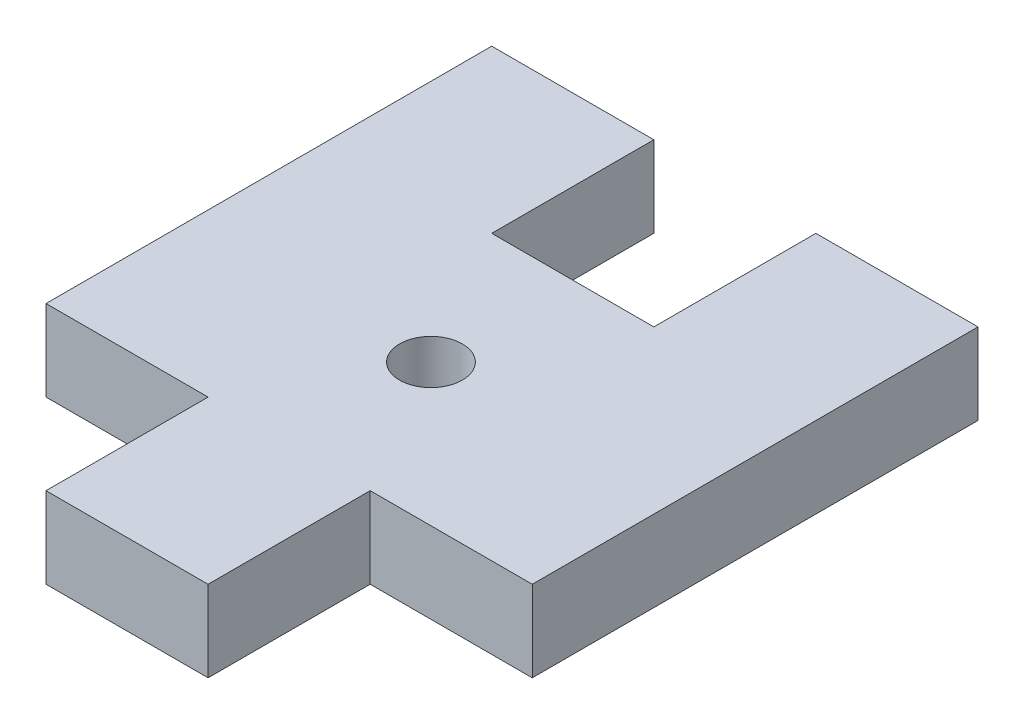
ISO-10303-21;
HEADER;
FILE_DESCRIPTION(('STEP AP214'),'2;1');
FILE_NAME('part.step','',(''),(''),'','','');
FILE_SCHEMA(('AUTOMOTIVE_DESIGN { 1 0 10303 214 1 1 1 1 }'));
ENDSEC;
DATA;
#1=APPLICATION_CONTEXT('core data for automotive mechanical design processes');
#2=APPLICATION_PROTOCOL_DEFINITION('international standard','automotive_design',2000,#1);
#3=PRODUCT_CONTEXT('',#1,'mechanical');
#4=PRODUCT('Part','Part','',(#3));
#5=PRODUCT_RELATED_PRODUCT_CATEGORY('part','',(#4));
#6=PRODUCT_DEFINITION_FORMATION('','',#4);
#7=PRODUCT_DEFINITION_CONTEXT('part definition',#1,'design');
#8=PRODUCT_DEFINITION('design','',#6,#7);
#9=PRODUCT_DEFINITION_SHAPE('','',#8);
#10=(LENGTH_UNIT() NAMED_UNIT(*) SI_UNIT(.MILLI.,.METRE.));
#11=(NAMED_UNIT(*) PLANE_ANGLE_UNIT() SI_UNIT($,.RADIAN.));
#12=(NAMED_UNIT(*) SI_UNIT($,.STERADIAN.) SOLID_ANGLE_UNIT());
#13=UNCERTAINTY_MEASURE_WITH_UNIT(LENGTH_MEASURE(1.E-05),#10,'distance_accuracy_value','');
#14=(GEOMETRIC_REPRESENTATION_CONTEXT(3) GLOBAL_UNCERTAINTY_ASSIGNED_CONTEXT((#13)) GLOBAL_UNIT_ASSIGNED_CONTEXT((#10,
#11,#12)) REPRESENTATION_CONTEXT('',''));
#15=CARTESIAN_POINT('',(0.,0.,0.));
#16=DIRECTION('',(0.,0.,1.));
#17=DIRECTION('',(1.,0.,0.));
#18=AXIS2_PLACEMENT_3D('',#15,#16,#17);
#19=CARTESIAN_POINT('',(4.,0.,-7.));
#20=DIRECTION('',(0.,0.,-1.));
#21=DIRECTION('',(-1.,0.,0.));
#22=AXIS2_PLACEMENT_3D('',#19,#20,#21);
#23=PLANE('',#22);
#24=DIRECTION('',(-1.,0.,0.));
#25=VECTOR('',#24,1.);
#26=CARTESIAN_POINT('',(4.,4.,-7.));
#27=LINE('',#26,#25);
#28=CARTESIAN_POINT('',(4.,4.,-7.));
#29=VERTEX_POINT('',#28);
#30=CARTESIAN_POINT('',(-4.,4.,-7.));
#31=VERTEX_POINT('',#30);
#32=EDGE_CURVE('E158',#29,#31,#27,.T.);
#33=ORIENTED_EDGE('',*,*,#32,.F.);
#34=DIRECTION('',(0.,1.,0.));
#35=VECTOR('',#34,1.);
#36=CARTESIAN_POINT('',(4.,0.,-7.));
#37=LINE('',#36,#35);
#38=CARTESIAN_POINT('',(4.,0.,-7.));
#39=VERTEX_POINT('',#38);
#40=EDGE_CURVE('E11',#39,#29,#37,.T.);
#41=ORIENTED_EDGE('',*,*,#40,.F.);
#42=DIRECTION('',(-1.,0.,0.));
#43=VECTOR('',#42,1.);
#44=CARTESIAN_POINT('',(4.,0.,-7.));
#45=LINE('',#44,#43);
#46=CARTESIAN_POINT('',(-4.,0.,-7.));
#47=VERTEX_POINT('',#46);
#48=EDGE_CURVE('E191',#39,#47,#45,.T.);
#49=ORIENTED_EDGE('',*,*,#48,.T.);
#50=DIRECTION('',(0.,1.,0.));
#51=VECTOR('',#50,1.);
#52=CARTESIAN_POINT('',(-4.,0.,-7.));
#53=LINE('',#52,#51);
#54=EDGE_CURVE('E40',#47,#31,#53,.T.);
#55=ORIENTED_EDGE('',*,*,#54,.T.);
#56=EDGE_LOOP('',(#33,#41,#49,#55));
#57=FACE_BOUND('',#56,.T.);
#58=ADVANCED_FACE('F37',(#57),#23,.T.);
#59=CARTESIAN_POINT('',(4.,0.,-15.));
#60=DIRECTION('',(-1.,0.,0.));
#61=DIRECTION('',(0.,0.,1.));
#62=AXIS2_PLACEMENT_3D('',#59,#60,#61);
#63=PLANE('',#62);
#64=DIRECTION('',(0.,0.,1.));
#65=VECTOR('',#64,1.);
#66=CARTESIAN_POINT('',(4.,4.,-15.));
#67=LINE('',#66,#65);
#68=CARTESIAN_POINT('',(4.,4.,-15.));
#69=VERTEX_POINT('',#68);
#70=EDGE_CURVE('E189',#69,#29,#67,.T.);
#71=ORIENTED_EDGE('',*,*,#70,.F.);
#72=DIRECTION('',(0.,1.,0.));
#73=VECTOR('',#72,1.);
#74=CARTESIAN_POINT('',(4.,0.,-15.));
#75=LINE('',#74,#73);
#76=CARTESIAN_POINT('',(4.,0.,-15.));
#77=VERTEX_POINT('',#76);
#78=EDGE_CURVE('E46',#77,#69,#75,.T.);
#79=ORIENTED_EDGE('',*,*,#78,.F.);
#80=DIRECTION('',(0.,0.,1.));
#81=VECTOR('',#80,1.);
#82=CARTESIAN_POINT('',(4.,0.,-15.));
#83=LINE('',#82,#81);
#84=EDGE_CURVE('E148',#77,#39,#83,.T.);
#85=ORIENTED_EDGE('',*,*,#84,.T.);
#86=ORIENTED_EDGE('',*,*,#40,.T.);
#87=EDGE_LOOP('',(#71,#79,#85,#86));
#88=FACE_BOUND('',#87,.T.);
#89=ADVANCED_FACE('F211',(#88),#63,.T.);
#90=CARTESIAN_POINT('',(12.,0.,-15.));
#91=DIRECTION('',(0.,0.,-1.));
#92=DIRECTION('',(-1.,0.,0.));
#93=AXIS2_PLACEMENT_3D('',#90,#91,#92);
#94=PLANE('',#93);
#95=DIRECTION('',(-1.,0.,0.));
#96=VECTOR('',#95,1.);
#97=CARTESIAN_POINT('',(12.,4.,-15.));
#98=LINE('',#97,#96);
#99=CARTESIAN_POINT('',(12.,4.,-15.));
#100=VERTEX_POINT('',#99);
#101=EDGE_CURVE('E135',#100,#69,#98,.T.);
#102=ORIENTED_EDGE('',*,*,#101,.F.);
#103=DIRECTION('',(0.,1.,0.));
#104=VECTOR('',#103,1.);
#105=CARTESIAN_POINT('',(12.,0.,-15.));
#106=LINE('',#105,#104);
#107=CARTESIAN_POINT('',(12.,0.,-15.));
#108=VERTEX_POINT('',#107);
#109=EDGE_CURVE('E130',#108,#100,#106,.T.);
#110=ORIENTED_EDGE('',*,*,#109,.F.);
#111=DIRECTION('',(-1.,0.,0.));
#112=VECTOR('',#111,1.);
#113=CARTESIAN_POINT('',(12.,0.,-15.));
#114=LINE('',#113,#112);
#115=EDGE_CURVE('E133',#108,#77,#114,.T.);
#116=ORIENTED_EDGE('',*,*,#115,.T.);
#117=ORIENTED_EDGE('',*,*,#78,.T.);
#118=EDGE_LOOP('',(#102,#110,#116,#117));
#119=FACE_BOUND('',#118,.T.);
#120=ADVANCED_FACE('F132',(#119),#94,.T.);
#121=CARTESIAN_POINT('',(12.,0.,7.));
#122=DIRECTION('',(1.,0.,0.));
#123=DIRECTION('',(0.,0.,-1.));
#124=AXIS2_PLACEMENT_3D('',#121,#122,#123);
#125=PLANE('',#124);
#126=DIRECTION('',(0.,0.,-1.));
#127=VECTOR('',#126,1.);
#128=CARTESIAN_POINT('',(12.,4.,7.));
#129=LINE('',#128,#127);
#130=CARTESIAN_POINT('',(12.,4.,7.));
#131=VERTEX_POINT('',#130);
#132=EDGE_CURVE('E186',#131,#100,#129,.T.);
#133=ORIENTED_EDGE('',*,*,#132,.F.);
#134=DIRECTION('',(0.,1.,0.));
#135=VECTOR('',#134,1.);
#136=CARTESIAN_POINT('',(12.,0.,7.));
#137=LINE('',#136,#135);
#138=CARTESIAN_POINT('',(12.,0.,7.));
#139=VERTEX_POINT('',#138);
#140=EDGE_CURVE('E140',#139,#131,#137,.T.);
#141=ORIENTED_EDGE('',*,*,#140,.F.);
#142=DIRECTION('',(0.,0.,-1.));
#143=VECTOR('',#142,1.);
#144=CARTESIAN_POINT('',(12.,0.,7.));
#145=LINE('',#144,#143);
#146=EDGE_CURVE('E146',#139,#108,#145,.T.);
#147=ORIENTED_EDGE('',*,*,#146,.T.);
#148=ORIENTED_EDGE('',*,*,#109,.T.);
#149=EDGE_LOOP('',(#133,#141,#147,#148));
#150=FACE_BOUND('',#149,.T.);
#151=ADVANCED_FACE('F150',(#150),#125,.T.);
#152=CARTESIAN_POINT('',(4.,0.,7.));
#153=DIRECTION('',(0.,0.,1.));
#154=DIRECTION('',(1.,0.,0.));
#155=AXIS2_PLACEMENT_3D('',#152,#153,#154);
#156=PLANE('',#155);
#157=DIRECTION('',(1.,0.,0.));
#158=VECTOR('',#157,1.);
#159=CARTESIAN_POINT('',(4.,4.,7.));
#160=LINE('',#159,#158);
#161=CARTESIAN_POINT('',(4.,4.,7.));
#162=VERTEX_POINT('',#161);
#163=EDGE_CURVE('E183',#162,#131,#160,.T.);
#164=ORIENTED_EDGE('',*,*,#163,.F.);
#165=DIRECTION('',(0.,1.,0.));
#166=VECTOR('',#165,1.);
#167=CARTESIAN_POINT('',(4.,0.,7.));
#168=LINE('',#167,#166);
#169=CARTESIAN_POINT('',(4.,0.,7.));
#170=VERTEX_POINT('',#169);
#171=EDGE_CURVE('E195',#170,#162,#168,.T.);
#172=ORIENTED_EDGE('',*,*,#171,.F.);
#173=DIRECTION('',(1.,0.,0.));
#174=VECTOR('',#173,1.);
#175=CARTESIAN_POINT('',(4.,0.,7.));
#176=LINE('',#175,#174);
#177=EDGE_CURVE('E151',#170,#139,#176,.T.);
#178=ORIENTED_EDGE('',*,*,#177,.T.);
#179=ORIENTED_EDGE('',*,*,#140,.T.);
#180=EDGE_LOOP('',(#164,#172,#178,#179));
#181=FACE_BOUND('',#180,.T.);
#182=ADVANCED_FACE('F224',(#181),#156,.T.);
#183=CARTESIAN_POINT('',(4.,0.,15.));
#184=DIRECTION('',(1.,0.,0.));
#185=DIRECTION('',(0.,0.,-1.));
#186=AXIS2_PLACEMENT_3D('',#183,#184,#185);
#187=PLANE('',#186);
#188=DIRECTION('',(0.,0.,-1.));
#189=VECTOR('',#188,1.);
#190=CARTESIAN_POINT('',(4.,4.,15.));
#191=LINE('',#190,#189);
#192=CARTESIAN_POINT('',(4.,4.,15.));
#193=VERTEX_POINT('',#192);
#194=EDGE_CURVE('E180',#193,#162,#191,.T.);
#195=ORIENTED_EDGE('',*,*,#194,.F.);
#196=DIRECTION('',(0.,1.,0.));
#197=VECTOR('',#196,1.);
#198=CARTESIAN_POINT('',(4.,0.,15.));
#199=LINE('',#198,#197);
#200=CARTESIAN_POINT('',(4.,0.,15.));
#201=VERTEX_POINT('',#200);
#202=EDGE_CURVE('E197',#201,#193,#199,.T.);
#203=ORIENTED_EDGE('',*,*,#202,.F.);
#204=DIRECTION('',(0.,0.,-1.));
#205=VECTOR('',#204,1.);
#206=CARTESIAN_POINT('',(4.,0.,15.));
#207=LINE('',#206,#205);
#208=EDGE_CURVE('E153',#201,#170,#207,.T.);
#209=ORIENTED_EDGE('',*,*,#208,.T.);
#210=ORIENTED_EDGE('',*,*,#171,.T.);
#211=EDGE_LOOP('',(#195,#203,#209,#210));
#212=FACE_BOUND('',#211,.T.);
#213=ADVANCED_FACE('F227',(#212),#187,.T.);
#214=CARTESIAN_POINT('',(-4.,0.,15.));
#215=DIRECTION('',(0.,0.,1.));
#216=DIRECTION('',(1.,0.,0.));
#217=AXIS2_PLACEMENT_3D('',#214,#215,#216);
#218=PLANE('',#217);
#219=DIRECTION('',(1.,0.,0.));
#220=VECTOR('',#219,1.);
#221=CARTESIAN_POINT('',(-4.,4.,15.));
#222=LINE('',#221,#220);
#223=CARTESIAN_POINT('',(-4.,4.,15.));
#224=VERTEX_POINT('',#223);
#225=EDGE_CURVE('E177',#224,#193,#222,.T.);
#226=ORIENTED_EDGE('',*,*,#225,.F.);
#227=DIRECTION('',(0.,1.,0.));
#228=VECTOR('',#227,1.);
#229=CARTESIAN_POINT('',(-4.,0.,15.));
#230=LINE('',#229,#228);
#231=CARTESIAN_POINT('',(-4.,0.,15.));
#232=VERTEX_POINT('',#231);
#233=EDGE_CURVE('E199',#232,#224,#230,.T.);
#234=ORIENTED_EDGE('',*,*,#233,.F.);
#235=DIRECTION('',(1.,0.,0.));
#236=VECTOR('',#235,1.);
#237=CARTESIAN_POINT('',(-4.,0.,15.));
#238=LINE('',#237,#236);
#239=EDGE_CURVE('E290',#232,#201,#238,.T.);
#240=ORIENTED_EDGE('',*,*,#239,.T.);
#241=ORIENTED_EDGE('',*,*,#202,.T.);
#242=EDGE_LOOP('',(#226,#234,#240,#241));
#243=FACE_BOUND('',#242,.T.);
#244=ADVANCED_FACE('F231',(#243),#218,.T.);
#245=CARTESIAN_POINT('',(-4.,0.,7.));
#246=DIRECTION('',(-1.,0.,0.));
#247=DIRECTION('',(0.,0.,1.));
#248=AXIS2_PLACEMENT_3D('',#245,#246,#247);
#249=PLANE('',#248);
#250=DIRECTION('',(0.,0.,1.));
#251=VECTOR('',#250,1.);
#252=CARTESIAN_POINT('',(-4.,4.,7.));
#253=LINE('',#252,#251);
#254=CARTESIAN_POINT('',(-4.,4.,7.));
#255=VERTEX_POINT('',#254);
#256=EDGE_CURVE('E174',#255,#224,#253,.T.);
#257=ORIENTED_EDGE('',*,*,#256,.F.);
#258=DIRECTION('',(0.,1.,0.));
#259=VECTOR('',#258,1.);
#260=CARTESIAN_POINT('',(-4.,0.,7.));
#261=LINE('',#260,#259);
#262=CARTESIAN_POINT('',(-4.,0.,7.));
#263=VERTEX_POINT('',#262);
#264=EDGE_CURVE('E201',#263,#255,#261,.T.);
#265=ORIENTED_EDGE('',*,*,#264,.F.);
#266=DIRECTION('',(0.,0.,1.));
#267=VECTOR('',#266,1.);
#268=CARTESIAN_POINT('',(-4.,0.,7.));
#269=LINE('',#268,#267);
#270=EDGE_CURVE('E287',#263,#232,#269,.T.);
#271=ORIENTED_EDGE('',*,*,#270,.T.);
#272=ORIENTED_EDGE('',*,*,#233,.T.);
#273=EDGE_LOOP('',(#257,#265,#271,#272));
#274=FACE_BOUND('',#273,.T.);
#275=ADVANCED_FACE('F235',(#274),#249,.T.);
#276=CARTESIAN_POINT('',(-12.,0.,7.));
#277=DIRECTION('',(0.,0.,1.));
#278=DIRECTION('',(1.,0.,0.));
#279=AXIS2_PLACEMENT_3D('',#276,#277,#278);
#280=PLANE('',#279);
#281=DIRECTION('',(1.,0.,0.));
#282=VECTOR('',#281,1.);
#283=CARTESIAN_POINT('',(-12.,4.,7.));
#284=LINE('',#283,#282);
#285=CARTESIAN_POINT('',(-12.,4.,7.));
#286=VERTEX_POINT('',#285);
#287=EDGE_CURVE('E171',#286,#255,#284,.T.);
#288=ORIENTED_EDGE('',*,*,#287,.F.);
#289=DIRECTION('',(0.,1.,0.));
#290=VECTOR('',#289,1.);
#291=CARTESIAN_POINT('',(-12.,0.,7.));
#292=LINE('',#291,#290);
#293=CARTESIAN_POINT('',(-12.,0.,7.));
#294=VERTEX_POINT('',#293);
#295=EDGE_CURVE('E203',#294,#286,#292,.T.);
#296=ORIENTED_EDGE('',*,*,#295,.F.);
#297=DIRECTION('',(1.,0.,0.));
#298=VECTOR('',#297,1.);
#299=CARTESIAN_POINT('',(-12.,0.,7.));
#300=LINE('',#299,#298);
#301=EDGE_CURVE('E284',#294,#263,#300,.T.);
#302=ORIENTED_EDGE('',*,*,#301,.T.);
#303=ORIENTED_EDGE('',*,*,#264,.T.);
#304=EDGE_LOOP('',(#288,#296,#302,#303));
#305=FACE_BOUND('',#304,.T.);
#306=ADVANCED_FACE('F239',(#305),#280,.T.);
#307=CARTESIAN_POINT('',(-12.,0.,-15.));
#308=DIRECTION('',(-1.,0.,0.));
#309=DIRECTION('',(0.,0.,1.));
#310=AXIS2_PLACEMENT_3D('',#307,#308,#309);
#311=PLANE('',#310);
#312=DIRECTION('',(0.,0.,1.));
#313=VECTOR('',#312,1.);
#314=CARTESIAN_POINT('',(-12.,4.,-15.));
#315=LINE('',#314,#313);
#316=CARTESIAN_POINT('',(-12.,4.,-15.));
#317=VERTEX_POINT('',#316);
#318=EDGE_CURVE('E168',#317,#286,#315,.T.);
#319=ORIENTED_EDGE('',*,*,#318,.F.);
#320=DIRECTION('',(0.,1.,0.));
#321=VECTOR('',#320,1.);
#322=CARTESIAN_POINT('',(-12.,0.,-15.));
#323=LINE('',#322,#321);
#324=CARTESIAN_POINT('',(-12.,0.,-15.));
#325=VERTEX_POINT('',#324);
#326=EDGE_CURVE('E205',#325,#317,#323,.T.);
#327=ORIENTED_EDGE('',*,*,#326,.F.);
#328=DIRECTION('',(0.,0.,1.));
#329=VECTOR('',#328,1.);
#330=CARTESIAN_POINT('',(-12.,0.,-15.));
#331=LINE('',#330,#329);
#332=EDGE_CURVE('E281',#325,#294,#331,.T.);
#333=ORIENTED_EDGE('',*,*,#332,.T.);
#334=ORIENTED_EDGE('',*,*,#295,.T.);
#335=EDGE_LOOP('',(#319,#327,#333,#334));
#336=FACE_BOUND('',#335,.T.);
#337=ADVANCED_FACE('F243',(#336),#311,.T.);
#338=CARTESIAN_POINT('',(-4.,0.,-15.));
#339=DIRECTION('',(0.,0.,-1.));
#340=DIRECTION('',(-1.,0.,0.));
#341=AXIS2_PLACEMENT_3D('',#338,#339,#340);
#342=PLANE('',#341);
#343=DIRECTION('',(-1.,0.,0.));
#344=VECTOR('',#343,1.);
#345=CARTESIAN_POINT('',(-4.,4.,-15.));
#346=LINE('',#345,#344);
#347=CARTESIAN_POINT('',(-4.,4.,-15.));
#348=VERTEX_POINT('',#347);
#349=EDGE_CURVE('E165',#348,#317,#346,.T.);
#350=ORIENTED_EDGE('',*,*,#349,.F.);
#351=DIRECTION('',(0.,1.,0.));
#352=VECTOR('',#351,1.);
#353=CARTESIAN_POINT('',(-4.,0.,-15.));
#354=LINE('',#353,#352);
#355=CARTESIAN_POINT('',(-4.,0.,-15.));
#356=VERTEX_POINT('',#355);
#357=EDGE_CURVE('E206',#356,#348,#354,.T.);
#358=ORIENTED_EDGE('',*,*,#357,.F.);
#359=DIRECTION('',(-1.,0.,0.));
#360=VECTOR('',#359,1.);
#361=CARTESIAN_POINT('',(-4.,0.,-15.));
#362=LINE('',#361,#360);
#363=EDGE_CURVE('E278',#356,#325,#362,.T.);
#364=ORIENTED_EDGE('',*,*,#363,.T.);
#365=ORIENTED_EDGE('',*,*,#326,.T.);
#366=EDGE_LOOP('',(#350,#358,#364,#365));
#367=FACE_BOUND('',#366,.T.);
#368=ADVANCED_FACE('F247',(#367),#342,.T.);
#369=CARTESIAN_POINT('',(-4.,0.,-7.));
#370=DIRECTION('',(1.,0.,0.));
#371=DIRECTION('',(0.,0.,-1.));
#372=AXIS2_PLACEMENT_3D('',#369,#370,#371);
#373=PLANE('',#372);
#374=DIRECTION('',(0.,0.,-1.));
#375=VECTOR('',#374,1.);
#376=CARTESIAN_POINT('',(-4.,4.,-7.));
#377=LINE('',#376,#375);
#378=EDGE_CURVE('E161',#31,#348,#377,.T.);
#379=ORIENTED_EDGE('',*,*,#378,.F.);
#380=ORIENTED_EDGE('',*,*,#54,.F.);
#381=DIRECTION('',(0.,0.,-1.));
#382=VECTOR('',#381,1.);
#383=CARTESIAN_POINT('',(-4.,0.,-7.));
#384=LINE('',#383,#382);
#385=EDGE_CURVE('E276',#47,#356,#384,.T.);
#386=ORIENTED_EDGE('',*,*,#385,.T.);
#387=ORIENTED_EDGE('',*,*,#357,.T.);
#388=EDGE_LOOP('',(#379,#380,#386,#387));
#389=FACE_BOUND('',#388,.T.);
#390=ADVANCED_FACE('F208',(#389),#373,.T.);
#391=CARTESIAN_POINT('',(0.,0.,0.));
#392=DIRECTION('',(0.,-1.,0.));
#393=DIRECTION('',(0.,0.,-1.));
#394=AXIS2_PLACEMENT_3D('',#391,#392,#393);
#395=PLANE('',#394);
#396=CARTESIAN_POINT('',(0.,0.,0.));
#397=DIRECTION('',(0.,1.,0.));
#398=DIRECTION('',(0.,0.,-1.));
#399=AXIS2_PLACEMENT_3D('',#396,#397,#398);
#400=CIRCLE('',#399,1.55);
#401=CARTESIAN_POINT('',(0.,0.,-1.55000000000001));
#402=VERTEX_POINT('',#401);
#403=EDGE_CURVE('E162',#402,#402,#400,.T.);
#404=ORIENTED_EDGE('',*,*,#403,.T.);
#405=EDGE_LOOP('',(#404));
#406=FACE_BOUND('',#405,.T.);
#407=ORIENTED_EDGE('',*,*,#48,.F.);
#408=ORIENTED_EDGE('',*,*,#84,.F.);
#409=ORIENTED_EDGE('',*,*,#115,.F.);
#410=ORIENTED_EDGE('',*,*,#146,.F.);
#411=ORIENTED_EDGE('',*,*,#177,.F.);
#412=ORIENTED_EDGE('',*,*,#208,.F.);
#413=ORIENTED_EDGE('',*,*,#239,.F.);
#414=ORIENTED_EDGE('',*,*,#270,.F.);
#415=ORIENTED_EDGE('',*,*,#301,.F.);
#416=ORIENTED_EDGE('',*,*,#332,.F.);
#417=ORIENTED_EDGE('',*,*,#363,.F.);
#418=ORIENTED_EDGE('',*,*,#385,.F.);
#419=EDGE_LOOP('',(#407,#408,#409,#410,#411,#412,#413,#414,#415,#416,#417,#418));
#420=FACE_BOUND('',#419,.T.);
#421=ADVANCED_FACE('F144',(#406,#420),#395,.T.);
#422=CARTESIAN_POINT('',(0.,4.,0.));
#423=DIRECTION('',(0.,-1.,0.));
#424=DIRECTION('',(0.,0.,-1.));
#425=AXIS2_PLACEMENT_3D('',#422,#423,#424);
#426=PLANE('',#425);
#427=CARTESIAN_POINT('',(0.,4.,0.));
#428=DIRECTION('',(0.,1.,0.));
#429=DIRECTION('',(0.,0.,-1.));
#430=AXIS2_PLACEMENT_3D('',#427,#428,#429);
#431=CIRCLE('',#430,1.55);
#432=CARTESIAN_POINT('',(0.,4.,-1.55000000000001));
#433=VERTEX_POINT('',#432);
#434=EDGE_CURVE('E271',#433,#433,#431,.T.);
#435=ORIENTED_EDGE('',*,*,#434,.F.);
#436=EDGE_LOOP('',(#435));
#437=FACE_BOUND('',#436,.T.);
#438=ORIENTED_EDGE('',*,*,#32,.T.);
#439=ORIENTED_EDGE('',*,*,#378,.T.);
#440=ORIENTED_EDGE('',*,*,#349,.T.);
#441=ORIENTED_EDGE('',*,*,#318,.T.);
#442=ORIENTED_EDGE('',*,*,#287,.T.);
#443=ORIENTED_EDGE('',*,*,#256,.T.);
#444=ORIENTED_EDGE('',*,*,#225,.T.);
#445=ORIENTED_EDGE('',*,*,#194,.T.);
#446=ORIENTED_EDGE('',*,*,#163,.T.);
#447=ORIENTED_EDGE('',*,*,#132,.T.);
#448=ORIENTED_EDGE('',*,*,#101,.T.);
#449=ORIENTED_EDGE('',*,*,#70,.T.);
#450=EDGE_LOOP('',(#438,#439,#440,#441,#442,#443,#444,#445,#446,#447,#448,#449));
#451=FACE_BOUND('',#450,.T.);
#452=ADVANCED_FACE('F210',(#437,#451),#426,.F.);
#453=CARTESIAN_POINT('',(0.,0.,0.));
#454=DIRECTION('',(0.,1.,0.));
#455=DIRECTION('',(0.,0.,1.));
#456=AXIS2_PLACEMENT_3D('',#453,#454,#455);
#457=CYLINDRICAL_SURFACE('',#456,1.55);
#458=ORIENTED_EDGE('',*,*,#403,.F.);
#459=EDGE_LOOP('',(#458));
#460=FACE_BOUND('',#459,.T.);
#461=ORIENTED_EDGE('',*,*,#434,.T.);
#462=EDGE_LOOP('',(#461));
#463=FACE_BOUND('',#462,.T.);
#464=ADVANCED_FACE('F259',(#460,#463),#457,.F.);
#465=CLOSED_SHELL('',(#58,#89,#120,#151,#182,#213,#244,#275,#306,#337,#368,#390,#421,#452,#464));
#466=MANIFOLD_SOLID_BREP('B2',#465);
#467=ADVANCED_BREP_SHAPE_REPRESENTATION('',(#18,#466),#14);
#468=SHAPE_DEFINITION_REPRESENTATION(#9,#467);
ENDSEC;
END-ISO-10303-21;
